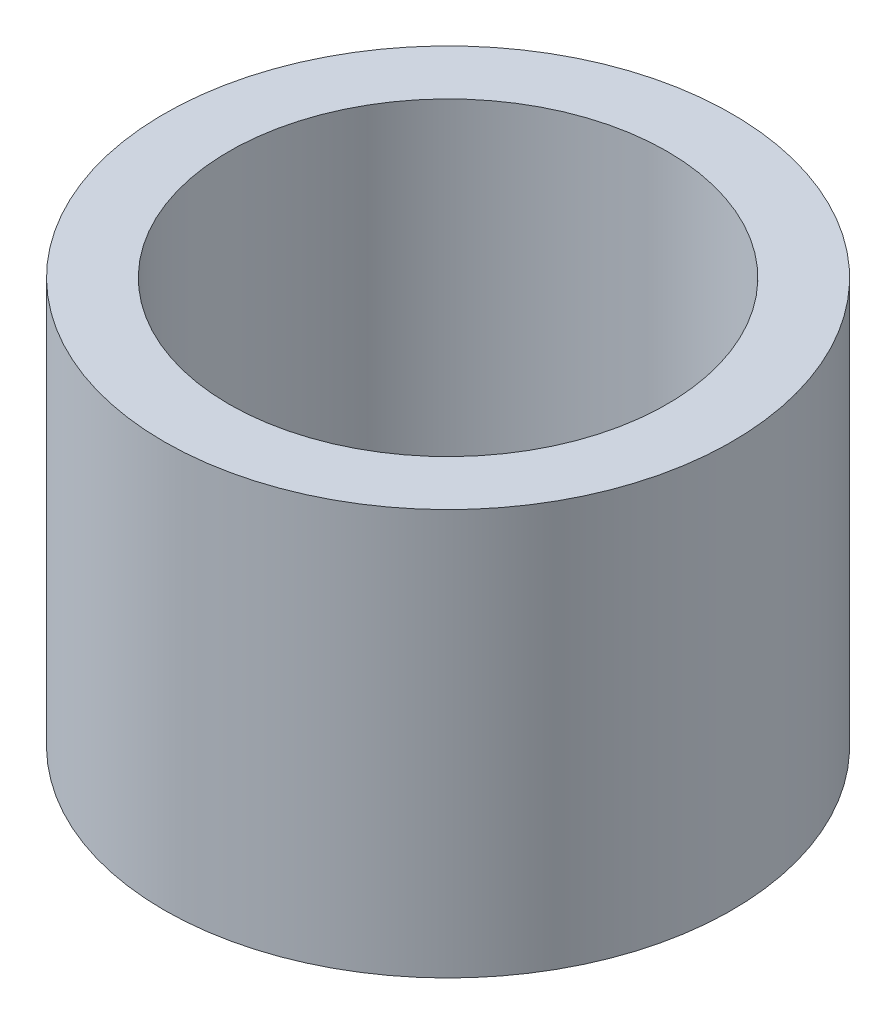
ISO-10303-21;
HEADER;
FILE_DESCRIPTION(('STEP AP214'),'2;1');
FILE_NAME('part.step','',(''),(''),'','','');
FILE_SCHEMA(('AUTOMOTIVE_DESIGN { 1 0 10303 214 1 1 1 1 }'));
ENDSEC;
DATA;
#1=APPLICATION_CONTEXT('core data for automotive mechanical design processes');
#2=APPLICATION_PROTOCOL_DEFINITION('international standard','automotive_design',2000,#1);
#3=PRODUCT_CONTEXT('',#1,'mechanical');
#4=PRODUCT('Part','Part','',(#3));
#5=PRODUCT_RELATED_PRODUCT_CATEGORY('part','',(#4));
#6=PRODUCT_DEFINITION_FORMATION('','',#4);
#7=PRODUCT_DEFINITION_CONTEXT('part definition',#1,'design');
#8=PRODUCT_DEFINITION('design','',#6,#7);
#9=PRODUCT_DEFINITION_SHAPE('','',#8);
#10=(LENGTH_UNIT() NAMED_UNIT(*) SI_UNIT(.MILLI.,.METRE.));
#11=(NAMED_UNIT(*) PLANE_ANGLE_UNIT() SI_UNIT($,.RADIAN.));
#12=(NAMED_UNIT(*) SI_UNIT($,.STERADIAN.) SOLID_ANGLE_UNIT());
#13=UNCERTAINTY_MEASURE_WITH_UNIT(LENGTH_MEASURE(1.E-05),#10,'distance_accuracy_value','');
#14=(GEOMETRIC_REPRESENTATION_CONTEXT(3) GLOBAL_UNCERTAINTY_ASSIGNED_CONTEXT((#13)) GLOBAL_UNIT_ASSIGNED_CONTEXT((#10,
#11,#12)) REPRESENTATION_CONTEXT('',''));
#15=CARTESIAN_POINT('',(0.,0.,0.));
#16=DIRECTION('',(0.,0.,1.));
#17=DIRECTION('',(1.,0.,0.));
#18=AXIS2_PLACEMENT_3D('',#15,#16,#17);
#19=CARTESIAN_POINT('',(0.,5.,0.));
#20=DIRECTION('',(0.,1.,0.));
#21=DIRECTION('',(0.,0.,1.));
#22=AXIS2_PLACEMENT_3D('',#19,#20,#21);
#23=PLANE('',#22);
#24=CARTESIAN_POINT('',(0.,5.,0.));
#25=DIRECTION('',(0.,1.,0.));
#26=DIRECTION('',(0.,0.,1.));
#27=AXIS2_PLACEMENT_3D('',#24,#25,#26);
#28=CIRCLE('',#27,3.5);
#29=CARTESIAN_POINT('',(0.,5.,3.5));
#30=VERTEX_POINT('',#29);
#31=EDGE_CURVE('E10',#30,#30,#28,.T.);
#32=ORIENTED_EDGE('',*,*,#31,.T.);
#33=EDGE_LOOP('',(#32));
#34=FACE_BOUND('',#33,.T.);
#35=CARTESIAN_POINT('',(0.,5.,0.));
#36=DIRECTION('',(0.,1.,0.));
#37=DIRECTION('',(0.,0.,1.));
#38=AXIS2_PLACEMENT_3D('',#35,#36,#37);
#39=CIRCLE('',#38,2.7);
#40=CARTESIAN_POINT('',(0.,5.,2.7));
#41=VERTEX_POINT('',#40);
#42=EDGE_CURVE('E42',#41,#41,#39,.T.);
#43=ORIENTED_EDGE('',*,*,#42,.F.);
#44=EDGE_LOOP('',(#43));
#45=FACE_BOUND('',#44,.T.);
#46=ADVANCED_FACE('F31',(#34,#45),#23,.T.);
#47=CARTESIAN_POINT('',(0.,0.,0.));
#48=DIRECTION('',(0.,1.,0.));
#49=DIRECTION('',(0.,0.,1.));
#50=AXIS2_PLACEMENT_3D('',#47,#48,#49);
#51=PLANE('',#50);
#52=CARTESIAN_POINT('',(0.,0.,0.));
#53=DIRECTION('',(0.,1.,0.));
#54=DIRECTION('',(0.,0.,1.));
#55=AXIS2_PLACEMENT_3D('',#52,#53,#54);
#56=CIRCLE('',#55,3.5);
#57=CARTESIAN_POINT('',(0.,0.,3.5));
#58=VERTEX_POINT('',#57);
#59=EDGE_CURVE('E35',#58,#58,#56,.T.);
#60=ORIENTED_EDGE('',*,*,#59,.F.);
#61=EDGE_LOOP('',(#60));
#62=FACE_BOUND('',#61,.T.);
#63=CARTESIAN_POINT('',(0.,0.,0.));
#64=DIRECTION('',(0.,1.,0.));
#65=DIRECTION('',(0.,0.,1.));
#66=AXIS2_PLACEMENT_3D('',#63,#64,#65);
#67=CIRCLE('',#66,2.7);
#68=CARTESIAN_POINT('',(0.,0.,2.7));
#69=VERTEX_POINT('',#68);
#70=EDGE_CURVE('E44',#69,#69,#67,.T.);
#71=ORIENTED_EDGE('',*,*,#70,.T.);
#72=EDGE_LOOP('',(#71));
#73=FACE_BOUND('',#72,.T.);
#74=ADVANCED_FACE('F54',(#62,#73),#51,.F.);
#75=CARTESIAN_POINT('',(0.,5.,0.));
#76=DIRECTION('',(0.,-1.,0.));
#77=DIRECTION('',(0.,0.,-1.));
#78=AXIS2_PLACEMENT_3D('',#75,#76,#77);
#79=CYLINDRICAL_SURFACE('',#78,3.5);
#80=ORIENTED_EDGE('',*,*,#31,.F.);
#81=EDGE_LOOP('',(#80));
#82=FACE_BOUND('',#81,.T.);
#83=ORIENTED_EDGE('',*,*,#59,.T.);
#84=EDGE_LOOP('',(#83));
#85=FACE_BOUND('',#84,.T.);
#86=ADVANCED_FACE('F33',(#82,#85),#79,.T.);
#87=CARTESIAN_POINT('',(0.,5.,0.));
#88=DIRECTION('',(0.,-1.,0.));
#89=DIRECTION('',(0.,0.,-1.));
#90=AXIS2_PLACEMENT_3D('',#87,#88,#89);
#91=CYLINDRICAL_SURFACE('',#90,2.7);
#92=ORIENTED_EDGE('',*,*,#42,.T.);
#93=EDGE_LOOP('',(#92));
#94=FACE_BOUND('',#93,.T.);
#95=ORIENTED_EDGE('',*,*,#70,.F.);
#96=EDGE_LOOP('',(#95));
#97=FACE_BOUND('',#96,.T.);
#98=ADVANCED_FACE('F50',(#94,#97),#91,.F.);
#99=CLOSED_SHELL('',(#46,#74,#86,#98));
#100=MANIFOLD_SOLID_BREP('B2',#99);
#101=ADVANCED_BREP_SHAPE_REPRESENTATION('',(#18,#100),#14);
#102=SHAPE_DEFINITION_REPRESENTATION(#9,#101);
ENDSEC;
END-ISO-10303-21;
